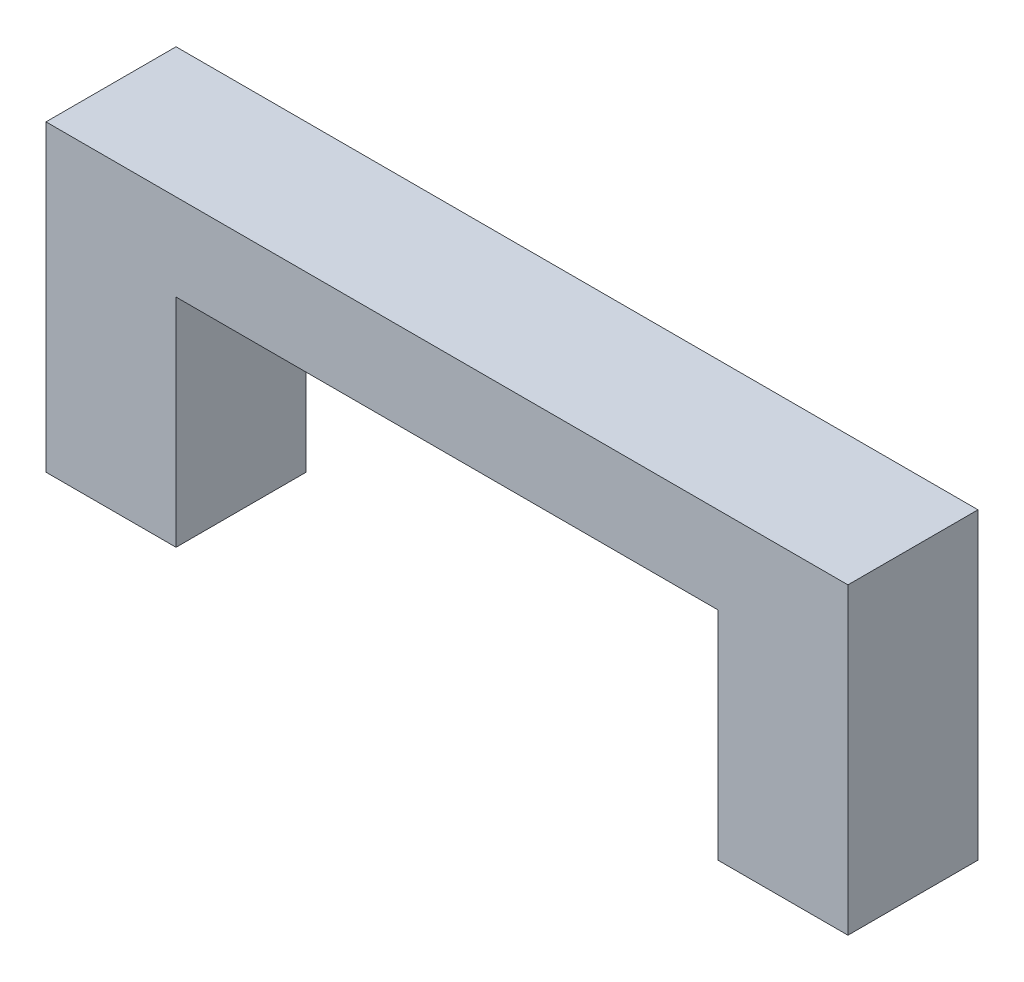
ISO-10303-21;
HEADER;
FILE_DESCRIPTION(('STEP AP214'),'2;1');
FILE_NAME('part.step','',(''),(''),'','','');
FILE_SCHEMA(('AUTOMOTIVE_DESIGN { 1 0 10303 214 1 1 1 1 }'));
ENDSEC;
DATA;
#1=APPLICATION_CONTEXT('core data for automotive mechanical design processes');
#2=APPLICATION_PROTOCOL_DEFINITION('international standard','automotive_design',2000,#1);
#3=PRODUCT_CONTEXT('',#1,'mechanical');
#4=PRODUCT('Part','Part','',(#3));
#5=PRODUCT_RELATED_PRODUCT_CATEGORY('part','',(#4));
#6=PRODUCT_DEFINITION_FORMATION('','',#4);
#7=PRODUCT_DEFINITION_CONTEXT('part definition',#1,'design');
#8=PRODUCT_DEFINITION('design','',#6,#7);
#9=PRODUCT_DEFINITION_SHAPE('','',#8);
#10=(LENGTH_UNIT() NAMED_UNIT(*) SI_UNIT(.MILLI.,.METRE.));
#11=(NAMED_UNIT(*) PLANE_ANGLE_UNIT() SI_UNIT($,.RADIAN.));
#12=(NAMED_UNIT(*) SI_UNIT($,.STERADIAN.) SOLID_ANGLE_UNIT());
#13=UNCERTAINTY_MEASURE_WITH_UNIT(LENGTH_MEASURE(1.E-05),#10,'distance_accuracy_value','');
#14=(GEOMETRIC_REPRESENTATION_CONTEXT(3) GLOBAL_UNCERTAINTY_ASSIGNED_CONTEXT((#13)) GLOBAL_UNIT_ASSIGNED_CONTEXT((#10,
#11,#12)) REPRESENTATION_CONTEXT('',''));
#15=CARTESIAN_POINT('',(0.,0.,0.));
#16=DIRECTION('',(0.,0.,1.));
#17=DIRECTION('',(1.,0.,0.));
#18=AXIS2_PLACEMENT_3D('',#15,#16,#17);
#19=CARTESIAN_POINT('',(18.5,0.,3.));
#20=DIRECTION('',(0.,1.,0.));
#21=DIRECTION('',(-1.,0.,0.));
#22=AXIS2_PLACEMENT_3D('',#19,#20,#21);
#23=PLANE('',#22);
#24=DIRECTION('',(1.,0.,0.));
#25=VECTOR('',#24,1.);
#26=CARTESIAN_POINT('',(18.5,0.,0.));
#27=LINE('',#26,#25);
#28=CARTESIAN_POINT('',(15.5,0.,0.));
#29=VERTEX_POINT('',#28);
#30=CARTESIAN_POINT('',(18.5,0.,0.));
#31=VERTEX_POINT('',#30);
#32=EDGE_CURVE('E236',#29,#31,#27,.T.);
#33=ORIENTED_EDGE('',*,*,#32,.T.);
#34=DIRECTION('',(0.,0.,-1.));
#35=VECTOR('',#34,1.);
#36=CARTESIAN_POINT('',(18.5,0.,3.));
#37=LINE('',#36,#35);
#38=CARTESIAN_POINT('',(18.5,0.,3.));
#39=VERTEX_POINT('',#38);
#40=EDGE_CURVE('E251',#39,#31,#37,.T.);
#41=ORIENTED_EDGE('',*,*,#40,.F.);
#42=DIRECTION('',(1.,0.,0.));
#43=VECTOR('',#42,1.);
#44=CARTESIAN_POINT('',(18.5,0.,3.));
#45=LINE('',#44,#43);
#46=CARTESIAN_POINT('',(15.5,0.,3.));
#47=VERTEX_POINT('',#46);
#48=EDGE_CURVE('E219',#47,#39,#45,.T.);
#49=ORIENTED_EDGE('',*,*,#48,.F.);
#50=DIRECTION('',(0.,0.,-1.));
#51=VECTOR('',#50,1.);
#52=CARTESIAN_POINT('',(15.5,0.,3.));
#53=LINE('',#52,#51);
#54=EDGE_CURVE('E254',#47,#29,#53,.T.);
#55=ORIENTED_EDGE('',*,*,#54,.T.);
#56=EDGE_LOOP('',(#33,#41,#49,#55));
#57=FACE_BOUND('',#56,.T.);
#58=DIRECTION('',(0.,0.,-1.));
#59=VECTOR('',#58,1.);
#60=CARTESIAN_POINT('',(17.75,0.,0.));
#61=LINE('',#60,#59);
#62=CARTESIAN_POINT('',(17.75,0.,2.25));
#63=VERTEX_POINT('',#62);
#64=CARTESIAN_POINT('',(17.75,0.,0.75));
#65=VERTEX_POINT('',#64);
#66=EDGE_CURVE('E56',#63,#65,#61,.T.);
#67=ORIENTED_EDGE('',*,*,#66,.T.);
#68=DIRECTION('',(1.,0.,0.));
#69=VECTOR('',#68,1.);
#70=CARTESIAN_POINT('',(0.,0.,0.75));
#71=LINE('',#70,#69);
#72=CARTESIAN_POINT('',(16.25,0.,0.75));
#73=VERTEX_POINT('',#72);
#74=EDGE_CURVE('E185',#73,#65,#71,.T.);
#75=ORIENTED_EDGE('',*,*,#74,.F.);
#76=DIRECTION('',(0.,0.,-1.));
#77=VECTOR('',#76,1.);
#78=CARTESIAN_POINT('',(16.25,0.,0.));
#79=LINE('',#78,#77);
#80=CARTESIAN_POINT('',(16.25,0.,2.25));
#81=VERTEX_POINT('',#80);
#82=EDGE_CURVE('E196',#81,#73,#79,.T.);
#83=ORIENTED_EDGE('',*,*,#82,.F.);
#84=DIRECTION('',(1.,0.,0.));
#85=VECTOR('',#84,1.);
#86=CARTESIAN_POINT('',(0.,0.,2.25));
#87=LINE('',#86,#85);
#88=EDGE_CURVE('E168',#81,#63,#87,.T.);
#89=ORIENTED_EDGE('',*,*,#88,.T.);
#90=EDGE_LOOP('',(#67,#75,#83,#89));
#91=FACE_BOUND('',#90,.T.);
#92=ADVANCED_FACE('F33',(#57,#91),#23,.F.);
#93=CARTESIAN_POINT('',(3.,0.,3.));
#94=DIRECTION('',(0.,1.,0.));
#95=DIRECTION('',(0.,0.,1.));
#96=AXIS2_PLACEMENT_3D('',#93,#94,#95);
#97=PLANE('',#96);
#98=DIRECTION('',(1.,0.,0.));
#99=VECTOR('',#98,1.);
#100=CARTESIAN_POINT('',(0.75,0.,0.75));
#101=LINE('',#100,#99);
#102=CARTESIAN_POINT('',(0.750000000000001,0.,0.75));
#103=VERTEX_POINT('',#102);
#104=CARTESIAN_POINT('',(2.25,0.,0.75));
#105=VERTEX_POINT('',#104);
#106=EDGE_CURVE('E166',#103,#105,#101,.T.);
#107=ORIENTED_EDGE('',*,*,#106,.F.);
#108=DIRECTION('',(0.,0.,-1.));
#109=VECTOR('',#108,1.);
#110=CARTESIAN_POINT('',(0.75,0.,2.25));
#111=LINE('',#110,#109);
#112=CARTESIAN_POINT('',(0.75,0.,2.25));
#113=VERTEX_POINT('',#112);
#114=EDGE_CURVE('E48',#113,#103,#111,.T.);
#115=ORIENTED_EDGE('',*,*,#114,.F.);
#116=DIRECTION('',(1.,0.,0.));
#117=VECTOR('',#116,1.);
#118=CARTESIAN_POINT('',(0.75,0.,2.25));
#119=LINE('',#118,#117);
#120=CARTESIAN_POINT('',(2.25,0.,2.25));
#121=VERTEX_POINT('',#120);
#122=EDGE_CURVE('E155',#113,#121,#119,.T.);
#123=ORIENTED_EDGE('',*,*,#122,.T.);
#124=DIRECTION('',(0.,0.,-1.));
#125=VECTOR('',#124,1.);
#126=CARTESIAN_POINT('',(2.25,0.,2.25));
#127=LINE('',#126,#125);
#128=EDGE_CURVE('E161',#121,#105,#127,.T.);
#129=ORIENTED_EDGE('',*,*,#128,.T.);
#130=EDGE_LOOP('',(#107,#115,#123,#129));
#131=FACE_BOUND('',#130,.T.);
#132=DIRECTION('',(1.,0.,0.));
#133=VECTOR('',#132,1.);
#134=CARTESIAN_POINT('',(3.,0.,0.));
#135=LINE('',#134,#133);
#136=CARTESIAN_POINT('',(0.,0.,0.));
#137=VERTEX_POINT('',#136);
#138=CARTESIAN_POINT('',(3.,0.,0.));
#139=VERTEX_POINT('',#138);
#140=EDGE_CURVE('E203',#137,#139,#135,.T.);
#141=ORIENTED_EDGE('',*,*,#140,.T.);
#142=DIRECTION('',(0.,0.,-1.));
#143=VECTOR('',#142,1.);
#144=CARTESIAN_POINT('',(3.,0.,3.));
#145=LINE('',#144,#143);
#146=CARTESIAN_POINT('',(3.,0.,3.));
#147=VERTEX_POINT('',#146);
#148=EDGE_CURVE('E11',#147,#139,#145,.T.);
#149=ORIENTED_EDGE('',*,*,#148,.F.);
#150=DIRECTION('',(1.,0.,0.));
#151=VECTOR('',#150,1.);
#152=CARTESIAN_POINT('',(3.,0.,3.));
#153=LINE('',#152,#151);
#154=CARTESIAN_POINT('',(0.,0.,3.));
#155=VERTEX_POINT('',#154);
#156=EDGE_CURVE('E209',#155,#147,#153,.T.);
#157=ORIENTED_EDGE('',*,*,#156,.F.);
#158=DIRECTION('',(0.,0.,-1.));
#159=VECTOR('',#158,1.);
#160=CARTESIAN_POINT('',(0.,0.,3.));
#161=LINE('',#160,#159);
#162=EDGE_CURVE('E227',#155,#137,#161,.T.);
#163=ORIENTED_EDGE('',*,*,#162,.T.);
#164=EDGE_LOOP('',(#141,#149,#157,#163));
#165=FACE_BOUND('',#164,.T.);
#166=ADVANCED_FACE('F35',(#131,#165),#97,.F.);
#167=CARTESIAN_POINT('',(3.,5.,3.));
#168=DIRECTION('',(-1.,0.,0.));
#169=DIRECTION('',(0.,0.,1.));
#170=AXIS2_PLACEMENT_3D('',#167,#168,#169);
#171=PLANE('',#170);
#172=DIRECTION('',(0.,1.,0.));
#173=VECTOR('',#172,1.);
#174=CARTESIAN_POINT('',(3.,5.,0.));
#175=LINE('',#174,#173);
#176=CARTESIAN_POINT('',(3.,5.,0.));
#177=VERTEX_POINT('',#176);
#178=EDGE_CURVE('E230',#139,#177,#175,.T.);
#179=ORIENTED_EDGE('',*,*,#178,.T.);
#180=DIRECTION('',(0.,0.,-1.));
#181=VECTOR('',#180,1.);
#182=CARTESIAN_POINT('',(3.,5.,3.));
#183=LINE('',#182,#181);
#184=CARTESIAN_POINT('',(3.,5.,3.));
#185=VERTEX_POINT('',#184);
#186=EDGE_CURVE('E41',#185,#177,#183,.T.);
#187=ORIENTED_EDGE('',*,*,#186,.F.);
#188=DIRECTION('',(0.,1.,0.));
#189=VECTOR('',#188,1.);
#190=CARTESIAN_POINT('',(3.,5.,3.));
#191=LINE('',#190,#189);
#192=EDGE_CURVE('E212',#147,#185,#191,.T.);
#193=ORIENTED_EDGE('',*,*,#192,.F.);
#194=ORIENTED_EDGE('',*,*,#148,.T.);
#195=EDGE_LOOP('',(#179,#187,#193,#194));
#196=FACE_BOUND('',#195,.T.);
#197=ADVANCED_FACE('F287',(#196),#171,.F.);
#198=CARTESIAN_POINT('',(15.5,5.,3.));
#199=DIRECTION('',(0.,1.,0.));
#200=DIRECTION('',(-1.,0.,0.));
#201=AXIS2_PLACEMENT_3D('',#198,#199,#200);
#202=PLANE('',#201);
#203=DIRECTION('',(1.,0.,0.));
#204=VECTOR('',#203,1.);
#205=CARTESIAN_POINT('',(15.5,5.,0.));
#206=LINE('',#205,#204);
#207=CARTESIAN_POINT('',(15.5,5.,0.));
#208=VERTEX_POINT('',#207);
#209=EDGE_CURVE('E232',#177,#208,#206,.T.);
#210=ORIENTED_EDGE('',*,*,#209,.T.);
#211=DIRECTION('',(0.,0.,-1.));
#212=VECTOR('',#211,1.);
#213=CARTESIAN_POINT('',(15.5,5.,3.));
#214=LINE('',#213,#212);
#215=CARTESIAN_POINT('',(15.5,5.,3.));
#216=VERTEX_POINT('',#215);
#217=EDGE_CURVE('E257',#216,#208,#214,.T.);
#218=ORIENTED_EDGE('',*,*,#217,.F.);
#219=DIRECTION('',(1.,0.,0.));
#220=VECTOR('',#219,1.);
#221=CARTESIAN_POINT('',(15.5,5.,3.));
#222=LINE('',#221,#220);
#223=EDGE_CURVE('E215',#185,#216,#222,.T.);
#224=ORIENTED_EDGE('',*,*,#223,.F.);
#225=ORIENTED_EDGE('',*,*,#186,.T.);
#226=EDGE_LOOP('',(#210,#218,#224,#225));
#227=FACE_BOUND('',#226,.T.);
#228=ADVANCED_FACE('F264',(#227),#202,.F.);
#229=CARTESIAN_POINT('',(15.5,0.,3.));
#230=DIRECTION('',(1.,0.,0.));
#231=DIRECTION('',(0.,0.,-1.));
#232=AXIS2_PLACEMENT_3D('',#229,#230,#231);
#233=PLANE('',#232);
#234=DIRECTION('',(0.,-1.,0.));
#235=VECTOR('',#234,1.);
#236=CARTESIAN_POINT('',(15.5,0.,0.));
#237=LINE('',#236,#235);
#238=EDGE_CURVE('E234',#208,#29,#237,.T.);
#239=ORIENTED_EDGE('',*,*,#238,.T.);
#240=ORIENTED_EDGE('',*,*,#54,.F.);
#241=DIRECTION('',(0.,-1.,0.));
#242=VECTOR('',#241,1.);
#243=CARTESIAN_POINT('',(15.5,0.,3.));
#244=LINE('',#243,#242);
#245=EDGE_CURVE('E217',#216,#47,#244,.T.);
#246=ORIENTED_EDGE('',*,*,#245,.F.);
#247=ORIENTED_EDGE('',*,*,#217,.T.);
#248=EDGE_LOOP('',(#239,#240,#246,#247));
#249=FACE_BOUND('',#248,.T.);
#250=ADVANCED_FACE('F275',(#249),#233,.F.);
#251=CARTESIAN_POINT('',(18.5,7.,3.));
#252=DIRECTION('',(-1.,0.,0.));
#253=DIRECTION('',(0.,0.,1.));
#254=AXIS2_PLACEMENT_3D('',#251,#252,#253);
#255=PLANE('',#254);
#256=DIRECTION('',(0.,1.,0.));
#257=VECTOR('',#256,1.);
#258=CARTESIAN_POINT('',(18.5,7.,0.));
#259=LINE('',#258,#257);
#260=CARTESIAN_POINT('',(18.5,7.,0.));
#261=VERTEX_POINT('',#260);
#262=EDGE_CURVE('E238',#31,#261,#259,.T.);
#263=ORIENTED_EDGE('',*,*,#262,.T.);
#264=DIRECTION('',(0.,0.,-1.));
#265=VECTOR('',#264,1.);
#266=CARTESIAN_POINT('',(18.5,7.,3.));
#267=LINE('',#266,#265);
#268=CARTESIAN_POINT('',(18.5,7.,3.));
#269=VERTEX_POINT('',#268);
#270=EDGE_CURVE('E248',#269,#261,#267,.T.);
#271=ORIENTED_EDGE('',*,*,#270,.F.);
#272=DIRECTION('',(0.,1.,0.));
#273=VECTOR('',#272,1.);
#274=CARTESIAN_POINT('',(18.5,7.,3.));
#275=LINE('',#274,#273);
#276=EDGE_CURVE('E221',#39,#269,#275,.T.);
#277=ORIENTED_EDGE('',*,*,#276,.F.);
#278=ORIENTED_EDGE('',*,*,#40,.T.);
#279=EDGE_LOOP('',(#263,#271,#277,#278));
#280=FACE_BOUND('',#279,.T.);
#281=ADVANCED_FACE('F299',(#280),#255,.F.);
#282=CARTESIAN_POINT('',(0.,7.,3.));
#283=DIRECTION('',(0.,-1.,0.));
#284=DIRECTION('',(0.,0.,-1.));
#285=AXIS2_PLACEMENT_3D('',#282,#283,#284);
#286=PLANE('',#285);
#287=DIRECTION('',(-1.,0.,0.));
#288=VECTOR('',#287,1.);
#289=CARTESIAN_POINT('',(0.,7.,0.));
#290=LINE('',#289,#288);
#291=CARTESIAN_POINT('',(0.,7.,0.));
#292=VERTEX_POINT('',#291);
#293=EDGE_CURVE('E240',#261,#292,#290,.T.);
#294=ORIENTED_EDGE('',*,*,#293,.T.);
#295=DIRECTION('',(0.,0.,-1.));
#296=VECTOR('',#295,1.);
#297=CARTESIAN_POINT('',(0.,7.,3.));
#298=LINE('',#297,#296);
#299=CARTESIAN_POINT('',(0.,7.,3.));
#300=VERTEX_POINT('',#299);
#301=EDGE_CURVE('E245',#300,#292,#298,.T.);
#302=ORIENTED_EDGE('',*,*,#301,.F.);
#303=DIRECTION('',(-1.,0.,0.));
#304=VECTOR('',#303,1.);
#305=CARTESIAN_POINT('',(0.,7.,3.));
#306=LINE('',#305,#304);
#307=EDGE_CURVE('E223',#269,#300,#306,.T.);
#308=ORIENTED_EDGE('',*,*,#307,.F.);
#309=ORIENTED_EDGE('',*,*,#270,.T.);
#310=EDGE_LOOP('',(#294,#302,#308,#309));
#311=FACE_BOUND('',#310,.T.);
#312=ADVANCED_FACE('F297',(#311),#286,.F.);
#313=CARTESIAN_POINT('',(0.,0.,3.));
#314=DIRECTION('',(1.,0.,0.));
#315=DIRECTION('',(0.,0.,-1.));
#316=AXIS2_PLACEMENT_3D('',#313,#314,#315);
#317=PLANE('',#316);
#318=DIRECTION('',(0.,-1.,0.));
#319=VECTOR('',#318,1.);
#320=CARTESIAN_POINT('',(0.,0.,0.));
#321=LINE('',#320,#319);
#322=EDGE_CURVE('E213',#292,#137,#321,.T.);
#323=ORIENTED_EDGE('',*,*,#322,.T.);
#324=ORIENTED_EDGE('',*,*,#162,.F.);
#325=DIRECTION('',(0.,-1.,0.));
#326=VECTOR('',#325,1.);
#327=CARTESIAN_POINT('',(0.,0.,3.));
#328=LINE('',#327,#326);
#329=EDGE_CURVE('E225',#300,#155,#328,.T.);
#330=ORIENTED_EDGE('',*,*,#329,.F.);
#331=ORIENTED_EDGE('',*,*,#301,.T.);
#332=EDGE_LOOP('',(#323,#324,#330,#331));
#333=FACE_BOUND('',#332,.T.);
#334=ADVANCED_FACE('F292',(#333),#317,.F.);
#335=CARTESIAN_POINT('',(0.,0.,3.));
#336=DIRECTION('',(0.,0.,-1.));
#337=DIRECTION('',(-1.,0.,0.));
#338=AXIS2_PLACEMENT_3D('',#335,#336,#337);
#339=PLANE('',#338);
#340=ORIENTED_EDGE('',*,*,#156,.T.);
#341=ORIENTED_EDGE('',*,*,#192,.T.);
#342=ORIENTED_EDGE('',*,*,#223,.T.);
#343=ORIENTED_EDGE('',*,*,#245,.T.);
#344=ORIENTED_EDGE('',*,*,#48,.T.);
#345=ORIENTED_EDGE('',*,*,#276,.T.);
#346=ORIENTED_EDGE('',*,*,#307,.T.);
#347=ORIENTED_EDGE('',*,*,#329,.T.);
#348=EDGE_LOOP('',(#340,#341,#342,#343,#344,#345,#346,#347));
#349=FACE_BOUND('',#348,.T.);
#350=ADVANCED_FACE('F283',(#349),#339,.F.);
#351=CARTESIAN_POINT('',(0.,0.,0.));
#352=DIRECTION('',(0.,0.,-1.));
#353=DIRECTION('',(-1.,0.,0.));
#354=AXIS2_PLACEMENT_3D('',#351,#352,#353);
#355=PLANE('',#354);
#356=ORIENTED_EDGE('',*,*,#140,.F.);
#357=ORIENTED_EDGE('',*,*,#322,.F.);
#358=ORIENTED_EDGE('',*,*,#293,.F.);
#359=ORIENTED_EDGE('',*,*,#262,.F.);
#360=ORIENTED_EDGE('',*,*,#32,.F.);
#361=ORIENTED_EDGE('',*,*,#238,.F.);
#362=ORIENTED_EDGE('',*,*,#209,.F.);
#363=ORIENTED_EDGE('',*,*,#178,.F.);
#364=EDGE_LOOP('',(#356,#357,#358,#359,#360,#361,#362,#363));
#365=FACE_BOUND('',#364,.T.);
#366=ADVANCED_FACE('F270',(#365),#355,.T.);
#367=CARTESIAN_POINT('',(17.75,2.2,0.));
#368=DIRECTION('',(-1.,0.,0.));
#369=DIRECTION('',(0.,0.,1.));
#370=AXIS2_PLACEMENT_3D('',#367,#368,#369);
#371=PLANE('',#370);
#372=ORIENTED_EDGE('',*,*,#66,.F.);
#373=DIRECTION('',(0.,-1.,0.));
#374=VECTOR('',#373,1.);
#375=CARTESIAN_POINT('',(17.75,2.2,2.25));
#376=LINE('',#375,#374);
#377=CARTESIAN_POINT('',(17.75,2.2,2.25));
#378=VERTEX_POINT('',#377);
#379=EDGE_CURVE('E192',#378,#63,#376,.T.);
#380=ORIENTED_EDGE('',*,*,#379,.F.);
#381=DIRECTION('',(0.,0.,-1.));
#382=VECTOR('',#381,1.);
#383=CARTESIAN_POINT('',(17.75,2.2,0.));
#384=LINE('',#383,#382);
#385=CARTESIAN_POINT('',(17.75,2.2,0.75));
#386=VERTEX_POINT('',#385);
#387=EDGE_CURVE('E182',#378,#386,#384,.T.);
#388=ORIENTED_EDGE('',*,*,#387,.T.);
#389=DIRECTION('',(0.,-1.,0.));
#390=VECTOR('',#389,1.);
#391=CARTESIAN_POINT('',(17.75,2.2,0.75));
#392=LINE('',#391,#390);
#393=EDGE_CURVE('E201',#386,#65,#392,.T.);
#394=ORIENTED_EDGE('',*,*,#393,.T.);
#395=EDGE_LOOP('',(#372,#380,#388,#394));
#396=FACE_BOUND('',#395,.T.);
#397=ADVANCED_FACE('F362',(#396),#371,.T.);
#398=CARTESIAN_POINT('',(0.,2.2,0.75));
#399=DIRECTION('',(0.,0.,-1.));
#400=DIRECTION('',(-1.,0.,0.));
#401=AXIS2_PLACEMENT_3D('',#398,#399,#400);
#402=PLANE('',#401);
#403=ORIENTED_EDGE('',*,*,#74,.T.);
#404=ORIENTED_EDGE('',*,*,#393,.F.);
#405=DIRECTION('',(1.,0.,0.));
#406=VECTOR('',#405,1.);
#407=CARTESIAN_POINT('',(0.,2.2,0.75));
#408=LINE('',#407,#406);
#409=CARTESIAN_POINT('',(16.25,2.2,0.75));
#410=VERTEX_POINT('',#409);
#411=EDGE_CURVE('E190',#410,#386,#408,.T.);
#412=ORIENTED_EDGE('',*,*,#411,.F.);
#413=DIRECTION('',(0.,-1.,0.));
#414=VECTOR('',#413,1.);
#415=CARTESIAN_POINT('',(16.25,2.2,0.75));
#416=LINE('',#415,#414);
#417=EDGE_CURVE('E204',#410,#73,#416,.T.);
#418=ORIENTED_EDGE('',*,*,#417,.T.);
#419=EDGE_LOOP('',(#403,#404,#412,#418));
#420=FACE_BOUND('',#419,.T.);
#421=ADVANCED_FACE('F380',(#420),#402,.F.);
#422=CARTESIAN_POINT('',(16.25,2.2,0.));
#423=DIRECTION('',(-1.,0.,0.));
#424=DIRECTION('',(0.,0.,1.));
#425=AXIS2_PLACEMENT_3D('',#422,#423,#424);
#426=PLANE('',#425);
#427=ORIENTED_EDGE('',*,*,#82,.T.);
#428=ORIENTED_EDGE('',*,*,#417,.F.);
#429=DIRECTION('',(0.,0.,-1.));
#430=VECTOR('',#429,1.);
#431=CARTESIAN_POINT('',(16.25,2.2,0.));
#432=LINE('',#431,#430);
#433=CARTESIAN_POINT('',(16.25,2.2,2.25));
#434=VERTEX_POINT('',#433);
#435=EDGE_CURVE('E187',#434,#410,#432,.T.);
#436=ORIENTED_EDGE('',*,*,#435,.F.);
#437=DIRECTION('',(0.,-1.,0.));
#438=VECTOR('',#437,1.);
#439=CARTESIAN_POINT('',(16.25,2.2,2.25));
#440=LINE('',#439,#438);
#441=EDGE_CURVE('E206',#434,#81,#440,.T.);
#442=ORIENTED_EDGE('',*,*,#441,.T.);
#443=EDGE_LOOP('',(#427,#428,#436,#442));
#444=FACE_BOUND('',#443,.T.);
#445=ADVANCED_FACE('F389',(#444),#426,.F.);
#446=CARTESIAN_POINT('',(0.,2.2,2.25));
#447=DIRECTION('',(0.,0.,-1.));
#448=DIRECTION('',(-1.,0.,0.));
#449=AXIS2_PLACEMENT_3D('',#446,#447,#448);
#450=PLANE('',#449);
#451=ORIENTED_EDGE('',*,*,#88,.F.);
#452=ORIENTED_EDGE('',*,*,#441,.F.);
#453=DIRECTION('',(1.,0.,0.));
#454=VECTOR('',#453,1.);
#455=CARTESIAN_POINT('',(0.,2.2,2.25));
#456=LINE('',#455,#454);
#457=EDGE_CURVE('E184',#434,#378,#456,.T.);
#458=ORIENTED_EDGE('',*,*,#457,.T.);
#459=ORIENTED_EDGE('',*,*,#379,.T.);
#460=EDGE_LOOP('',(#451,#452,#458,#459));
#461=FACE_BOUND('',#460,.T.);
#462=ADVANCED_FACE('F399',(#461),#450,.T.);
#463=CARTESIAN_POINT('',(0.,2.2,0.));
#464=DIRECTION('',(0.,-1.,0.));
#465=DIRECTION('',(0.,0.,-1.));
#466=AXIS2_PLACEMENT_3D('',#463,#464,#465);
#467=PLANE('',#466);
#468=ORIENTED_EDGE('',*,*,#387,.F.);
#469=ORIENTED_EDGE('',*,*,#457,.F.);
#470=ORIENTED_EDGE('',*,*,#435,.T.);
#471=ORIENTED_EDGE('',*,*,#411,.T.);
#472=EDGE_LOOP('',(#468,#469,#470,#471));
#473=FACE_BOUND('',#472,.T.);
#474=ADVANCED_FACE('F409',(#473),#467,.T.);
#475=CARTESIAN_POINT('',(0.75,2.2,2.25));
#476=DIRECTION('',(-1.,0.,0.));
#477=DIRECTION('',(0.,0.,1.));
#478=AXIS2_PLACEMENT_3D('',#475,#476,#477);
#479=PLANE('',#478);
#480=ORIENTED_EDGE('',*,*,#114,.T.);
#481=DIRECTION('',(0.,-1.,0.));
#482=VECTOR('',#481,1.);
#483=CARTESIAN_POINT('',(0.75,2.2,0.75));
#484=LINE('',#483,#482);
#485=CARTESIAN_POINT('',(0.75,2.2,0.75));
#486=VERTEX_POINT('',#485);
#487=EDGE_CURVE('E176',#486,#103,#484,.T.);
#488=ORIENTED_EDGE('',*,*,#487,.F.);
#489=DIRECTION('',(0.,0.,-1.));
#490=VECTOR('',#489,1.);
#491=CARTESIAN_POINT('',(0.75,2.2,2.25));
#492=LINE('',#491,#490);
#493=CARTESIAN_POINT('',(0.75,2.2,2.25));
#494=VERTEX_POINT('',#493);
#495=EDGE_CURVE('E149',#494,#486,#492,.T.);
#496=ORIENTED_EDGE('',*,*,#495,.F.);
#497=DIRECTION('',(0.,-1.,0.));
#498=VECTOR('',#497,1.);
#499=CARTESIAN_POINT('',(0.75,2.2,2.25));
#500=LINE('',#499,#498);
#501=EDGE_CURVE('E145',#494,#113,#500,.T.);
#502=ORIENTED_EDGE('',*,*,#501,.T.);
#503=EDGE_LOOP('',(#480,#488,#496,#502));
#504=FACE_BOUND('',#503,.T.);
#505=ADVANCED_FACE('F147',(#504),#479,.F.);
#506=CARTESIAN_POINT('',(0.75,2.2,2.25));
#507=DIRECTION('',(0.,0.,-1.));
#508=DIRECTION('',(-1.,0.,0.));
#509=AXIS2_PLACEMENT_3D('',#506,#507,#508);
#510=PLANE('',#509);
#511=ORIENTED_EDGE('',*,*,#122,.F.);
#512=ORIENTED_EDGE('',*,*,#501,.F.);
#513=DIRECTION('',(1.,0.,0.));
#514=VECTOR('',#513,1.);
#515=CARTESIAN_POINT('',(0.75,2.2,2.25));
#516=LINE('',#515,#514);
#517=CARTESIAN_POINT('',(2.25,2.2,2.25));
#518=VERTEX_POINT('',#517);
#519=EDGE_CURVE('E173',#494,#518,#516,.T.);
#520=ORIENTED_EDGE('',*,*,#519,.T.);
#521=DIRECTION('',(0.,-1.,0.));
#522=VECTOR('',#521,1.);
#523=CARTESIAN_POINT('',(2.25,2.2,2.25));
#524=LINE('',#523,#522);
#525=EDGE_CURVE('E152',#518,#121,#524,.T.);
#526=ORIENTED_EDGE('',*,*,#525,.T.);
#527=EDGE_LOOP('',(#511,#512,#520,#526));
#528=FACE_BOUND('',#527,.T.);
#529=ADVANCED_FACE('F156',(#528),#510,.T.);
#530=CARTESIAN_POINT('',(2.25,2.2,2.25));
#531=DIRECTION('',(-1.,0.,0.));
#532=DIRECTION('',(0.,0.,1.));
#533=AXIS2_PLACEMENT_3D('',#530,#531,#532);
#534=PLANE('',#533);
#535=ORIENTED_EDGE('',*,*,#128,.F.);
#536=ORIENTED_EDGE('',*,*,#525,.F.);
#537=DIRECTION('',(0.,0.,-1.));
#538=VECTOR('',#537,1.);
#539=CARTESIAN_POINT('',(2.25,2.2,2.25));
#540=LINE('',#539,#538);
#541=CARTESIAN_POINT('',(2.25,2.2,0.75));
#542=VERTEX_POINT('',#541);
#543=EDGE_CURVE('E175',#518,#542,#540,.T.);
#544=ORIENTED_EDGE('',*,*,#543,.T.);
#545=DIRECTION('',(0.,-1.,0.));
#546=VECTOR('',#545,1.);
#547=CARTESIAN_POINT('',(2.25,2.2,0.75));
#548=LINE('',#547,#546);
#549=EDGE_CURVE('E472',#542,#105,#548,.T.);
#550=ORIENTED_EDGE('',*,*,#549,.T.);
#551=EDGE_LOOP('',(#535,#536,#544,#550));
#552=FACE_BOUND('',#551,.T.);
#553=ADVANCED_FACE('F436',(#552),#534,.T.);
#554=CARTESIAN_POINT('',(0.75,2.2,0.75));
#555=DIRECTION('',(0.,0.,-1.));
#556=DIRECTION('',(-1.,0.,0.));
#557=AXIS2_PLACEMENT_3D('',#554,#555,#556);
#558=PLANE('',#557);
#559=ORIENTED_EDGE('',*,*,#106,.T.);
#560=ORIENTED_EDGE('',*,*,#549,.F.);
#561=DIRECTION('',(1.,0.,0.));
#562=VECTOR('',#561,1.);
#563=CARTESIAN_POINT('',(0.75,2.2,0.75));
#564=LINE('',#563,#562);
#565=EDGE_CURVE('E178',#486,#542,#564,.T.);
#566=ORIENTED_EDGE('',*,*,#565,.F.);
#567=ORIENTED_EDGE('',*,*,#487,.T.);
#568=EDGE_LOOP('',(#559,#560,#566,#567));
#569=FACE_BOUND('',#568,.T.);
#570=ADVANCED_FACE('F445',(#569),#558,.F.);
#571=CARTESIAN_POINT('',(0.,2.2,0.));
#572=DIRECTION('',(0.,-1.,0.));
#573=DIRECTION('',(0.,0.,-1.));
#574=AXIS2_PLACEMENT_3D('',#571,#572,#573);
#575=PLANE('',#574);
#576=ORIENTED_EDGE('',*,*,#495,.T.);
#577=ORIENTED_EDGE('',*,*,#565,.T.);
#578=ORIENTED_EDGE('',*,*,#543,.F.);
#579=ORIENTED_EDGE('',*,*,#519,.F.);
#580=EDGE_LOOP('',(#576,#577,#578,#579));
#581=FACE_BOUND('',#580,.T.);
#582=ADVANCED_FACE('F455',(#581),#575,.T.);
#583=CLOSED_SHELL('',(#92,#166,#197,#228,#250,#281,#312,#334,#350,#366,#397,#421,#445,#462,#474,
#505,#529,#553,#570,#582));
#584=MANIFOLD_SOLID_BREP('B2',#583);
#585=ADVANCED_BREP_SHAPE_REPRESENTATION('',(#18,#584),#14);
#586=SHAPE_DEFINITION_REPRESENTATION(#9,#585);
ENDSEC;
END-ISO-10303-21;
